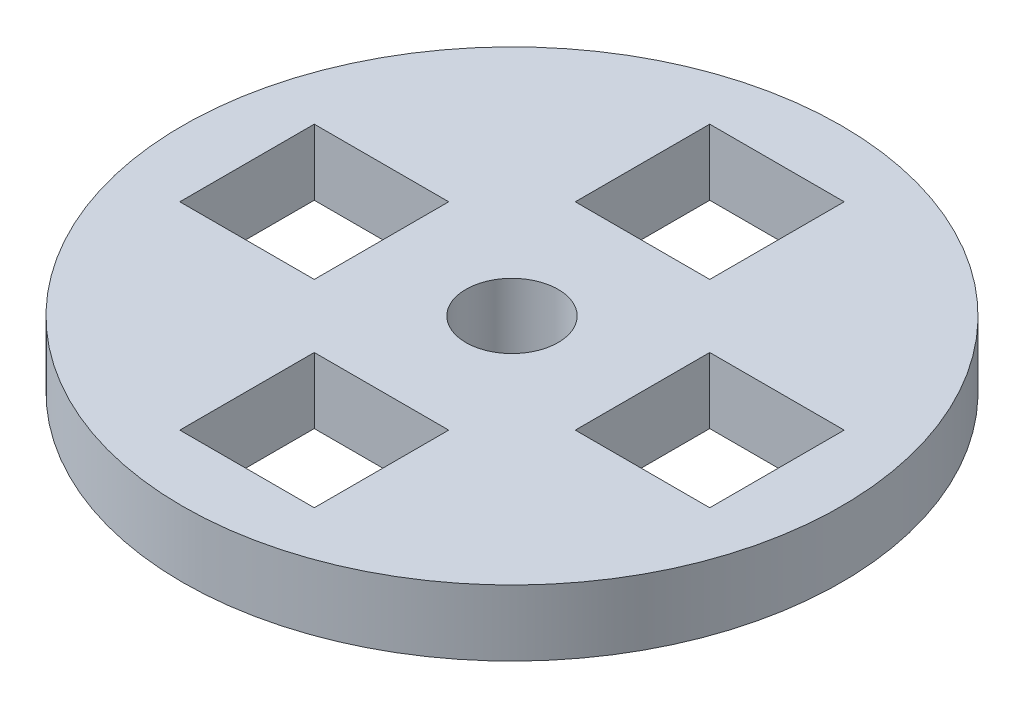
ISO-10303-21;
HEADER;
FILE_DESCRIPTION(('STEP AP214'),'2;1');
FILE_NAME('part.step','',(''),(''),'','','');
FILE_SCHEMA(('AUTOMOTIVE_DESIGN { 1 0 10303 214 1 1 1 1 }'));
ENDSEC;
DATA;
#1=APPLICATION_CONTEXT('core data for automotive mechanical design processes');
#2=APPLICATION_PROTOCOL_DEFINITION('international standard','automotive_design',2000,#1);
#3=PRODUCT_CONTEXT('',#1,'mechanical');
#4=PRODUCT('Part','Part','',(#3));
#5=PRODUCT_RELATED_PRODUCT_CATEGORY('part','',(#4));
#6=PRODUCT_DEFINITION_FORMATION('','',#4);
#7=PRODUCT_DEFINITION_CONTEXT('part definition',#1,'design');
#8=PRODUCT_DEFINITION('design','',#6,#7);
#9=PRODUCT_DEFINITION_SHAPE('','',#8);
#10=(LENGTH_UNIT() NAMED_UNIT(*) SI_UNIT(.MILLI.,.METRE.));
#11=(NAMED_UNIT(*) PLANE_ANGLE_UNIT() SI_UNIT($,.RADIAN.));
#12=(NAMED_UNIT(*) SI_UNIT($,.STERADIAN.) SOLID_ANGLE_UNIT());
#13=UNCERTAINTY_MEASURE_WITH_UNIT(LENGTH_MEASURE(1.E-05),#10,'distance_accuracy_value','');
#14=(GEOMETRIC_REPRESENTATION_CONTEXT(3) GLOBAL_UNCERTAINTY_ASSIGNED_CONTEXT((#13)) GLOBAL_UNIT_ASSIGNED_CONTEXT((#10,
#11,#12)) REPRESENTATION_CONTEXT('',''));
#15=CARTESIAN_POINT('',(0.,0.,0.));
#16=DIRECTION('',(0.,0.,1.));
#17=DIRECTION('',(1.,0.,0.));
#18=AXIS2_PLACEMENT_3D('',#15,#16,#17);
#19=CARTESIAN_POINT('',(0.,5.,0.));
#20=DIRECTION('',(0.,1.,0.));
#21=DIRECTION('',(0.,0.,1.));
#22=AXIS2_PLACEMENT_3D('',#19,#20,#21);
#23=PLANE('',#22);
#24=CARTESIAN_POINT('',(0.,5.,0.));
#25=DIRECTION('',(0.,1.,0.));
#26=DIRECTION('',(0.,0.,1.));
#27=AXIS2_PLACEMENT_3D('',#24,#25,#26);
#28=CIRCLE('',#27,3.5);
#29=CARTESIAN_POINT('',(0.,5.,3.5));
#30=VERTEX_POINT('',#29);
#31=EDGE_CURVE('E510',#30,#30,#28,.T.);
#32=ORIENTED_EDGE('',*,*,#31,.F.);
#33=EDGE_LOOP('',(#32));
#34=FACE_BOUND('',#33,.T.);
#35=CARTESIAN_POINT('',(0.,5.,0.));
#36=DIRECTION('',(0.,1.,0.));
#37=DIRECTION('',(0.,0.,1.));
#38=AXIS2_PLACEMENT_3D('',#35,#36,#37);
#39=CIRCLE('',#38,25.);
#40=CARTESIAN_POINT('',(0.,5.,25.));
#41=VERTEX_POINT('',#40);
#42=EDGE_CURVE('E11',#41,#41,#39,.T.);
#43=ORIENTED_EDGE('',*,*,#42,.T.);
#44=EDGE_LOOP('',(#43));
#45=FACE_BOUND('',#44,.T.);
#46=DIRECTION('',(-1.,0.,0.));
#47=VECTOR('',#46,1.);
#48=CARTESIAN_POINT('',(-20.1,5.,-5.09999999999998));
#49=LINE('',#48,#47);
#50=CARTESIAN_POINT('',(-9.9,5.,-5.09999999999998));
#51=VERTEX_POINT('',#50);
#52=CARTESIAN_POINT('',(-20.1,5.,-5.09999999999998));
#53=VERTEX_POINT('',#52);
#54=EDGE_CURVE('E249',#51,#53,#49,.T.);
#55=ORIENTED_EDGE('',*,*,#54,.F.);
#56=DIRECTION('',(0.,0.,-1.));
#57=VECTOR('',#56,1.);
#58=CARTESIAN_POINT('',(-9.9,5.,-5.09999999999998));
#59=LINE('',#58,#57);
#60=CARTESIAN_POINT('',(-9.9,5.,5.10000000000001));
#61=VERTEX_POINT('',#60);
#62=EDGE_CURVE('E247',#61,#51,#59,.T.);
#63=ORIENTED_EDGE('',*,*,#62,.F.);
#64=DIRECTION('',(1.,0.,0.));
#65=VECTOR('',#64,1.);
#66=CARTESIAN_POINT('',(-20.1,5.,5.10000000000001));
#67=LINE('',#66,#65);
#68=CARTESIAN_POINT('',(-20.1,5.,5.10000000000001));
#69=VERTEX_POINT('',#68);
#70=EDGE_CURVE('E255',#69,#61,#67,.T.);
#71=ORIENTED_EDGE('',*,*,#70,.F.);
#72=DIRECTION('',(0.,0.,1.));
#73=VECTOR('',#72,1.);
#74=CARTESIAN_POINT('',(-20.1,5.,-5.09999999999998));
#75=LINE('',#74,#73);
#76=EDGE_CURVE('E252',#53,#69,#75,.T.);
#77=ORIENTED_EDGE('',*,*,#76,.F.);
#78=EDGE_LOOP('',(#55,#63,#71,#77));
#79=FACE_BOUND('',#78,.T.);
#80=DIRECTION('',(1.,0.,0.));
#81=VECTOR('',#80,1.);
#82=CARTESIAN_POINT('',(20.1,5.,5.10000000000001));
#83=LINE('',#82,#81);
#84=CARTESIAN_POINT('',(9.9,5.,5.10000000000001));
#85=VERTEX_POINT('',#84);
#86=CARTESIAN_POINT('',(20.1,5.,5.10000000000001));
#87=VERTEX_POINT('',#86);
#88=EDGE_CURVE('E218',#85,#87,#83,.T.);
#89=ORIENTED_EDGE('',*,*,#88,.F.);
#90=DIRECTION('',(0.,0.,1.));
#91=VECTOR('',#90,1.);
#92=CARTESIAN_POINT('',(9.9,5.,-5.09999999999999));
#93=LINE('',#92,#91);
#94=CARTESIAN_POINT('',(9.9,5.,-5.09999999999999));
#95=VERTEX_POINT('',#94);
#96=EDGE_CURVE('E216',#95,#85,#93,.T.);
#97=ORIENTED_EDGE('',*,*,#96,.F.);
#98=DIRECTION('',(-1.,0.,0.));
#99=VECTOR('',#98,1.);
#100=CARTESIAN_POINT('',(20.1,5.,-5.09999999999999));
#101=LINE('',#100,#99);
#102=CARTESIAN_POINT('',(20.1,5.,-5.09999999999999));
#103=VERTEX_POINT('',#102);
#104=EDGE_CURVE('E224',#103,#95,#101,.T.);
#105=ORIENTED_EDGE('',*,*,#104,.F.);
#106=DIRECTION('',(0.,0.,-1.));
#107=VECTOR('',#106,1.);
#108=CARTESIAN_POINT('',(20.1,5.,-5.09999999999999));
#109=LINE('',#108,#107);
#110=EDGE_CURVE('E221',#87,#103,#109,.T.);
#111=ORIENTED_EDGE('',*,*,#110,.F.);
#112=EDGE_LOOP('',(#89,#97,#105,#111));
#113=FACE_BOUND('',#112,.T.);
#114=DIRECTION('',(-1.,0.,0.));
#115=VECTOR('',#114,1.);
#116=CARTESIAN_POINT('',(-5.1,5.,-20.1));
#117=LINE('',#116,#115);
#118=CARTESIAN_POINT('',(5.1,5.,-20.1));
#119=VERTEX_POINT('',#118);
#120=CARTESIAN_POINT('',(-5.1,5.,-20.1));
#121=VERTEX_POINT('',#120);
#122=EDGE_CURVE('E187',#119,#121,#117,.T.);
#123=ORIENTED_EDGE('',*,*,#122,.F.);
#124=DIRECTION('',(0.,0.,-1.));
#125=VECTOR('',#124,1.);
#126=CARTESIAN_POINT('',(5.1,5.,-20.1));
#127=LINE('',#126,#125);
#128=CARTESIAN_POINT('',(5.1,5.,-9.89999999999999));
#129=VERTEX_POINT('',#128);
#130=EDGE_CURVE('E185',#129,#119,#127,.T.);
#131=ORIENTED_EDGE('',*,*,#130,.F.);
#132=DIRECTION('',(1.,0.,0.));
#133=VECTOR('',#132,1.);
#134=CARTESIAN_POINT('',(-5.1,5.,-9.89999999999999));
#135=LINE('',#134,#133);
#136=CARTESIAN_POINT('',(-5.1,5.,-9.89999999999999));
#137=VERTEX_POINT('',#136);
#138=EDGE_CURVE('E193',#137,#129,#135,.T.);
#139=ORIENTED_EDGE('',*,*,#138,.F.);
#140=DIRECTION('',(0.,0.,1.));
#141=VECTOR('',#140,1.);
#142=CARTESIAN_POINT('',(-5.1,5.,-20.1));
#143=LINE('',#142,#141);
#144=EDGE_CURVE('E190',#121,#137,#143,.T.);
#145=ORIENTED_EDGE('',*,*,#144,.F.);
#146=EDGE_LOOP('',(#123,#131,#139,#145));
#147=FACE_BOUND('',#146,.T.);
#148=DIRECTION('',(-1.,0.,0.));
#149=VECTOR('',#148,1.);
#150=CARTESIAN_POINT('',(-5.1,5.,9.9));
#151=LINE('',#150,#149);
#152=CARTESIAN_POINT('',(5.1,5.,9.9));
#153=VERTEX_POINT('',#152);
#154=CARTESIAN_POINT('',(-5.1,5.,9.9));
#155=VERTEX_POINT('',#154);
#156=EDGE_CURVE('E156',#153,#155,#151,.T.);
#157=ORIENTED_EDGE('',*,*,#156,.F.);
#158=DIRECTION('',(0.,0.,-1.));
#159=VECTOR('',#158,1.);
#160=CARTESIAN_POINT('',(5.1,5.,9.9));
#161=LINE('',#160,#159);
#162=CARTESIAN_POINT('',(5.1,5.,20.1));
#163=VERTEX_POINT('',#162);
#164=EDGE_CURVE('E148',#163,#153,#161,.T.);
#165=ORIENTED_EDGE('',*,*,#164,.F.);
#166=DIRECTION('',(1.,0.,0.));
#167=VECTOR('',#166,1.);
#168=CARTESIAN_POINT('',(-5.09999999999999,5.,20.1));
#169=LINE('',#168,#167);
#170=CARTESIAN_POINT('',(-5.09999999999999,5.,20.1));
#171=VERTEX_POINT('',#170);
#172=EDGE_CURVE('E170',#171,#163,#169,.T.);
#173=ORIENTED_EDGE('',*,*,#172,.F.);
#174=DIRECTION('',(0.,0.,1.));
#175=VECTOR('',#174,1.);
#176=CARTESIAN_POINT('',(-5.1,5.,9.9));
#177=LINE('',#176,#175);
#178=EDGE_CURVE('E168',#155,#171,#177,.T.);
#179=ORIENTED_EDGE('',*,*,#178,.F.);
#180=EDGE_LOOP('',(#157,#165,#173,#179));
#181=FACE_BOUND('',#180,.T.);
#182=ADVANCED_FACE('F33',(#34,#45,#79,#113,#147,#181),#23,.T.);
#183=CARTESIAN_POINT('',(0.,0.,0.));
#184=DIRECTION('',(0.,1.,0.));
#185=DIRECTION('',(0.,0.,1.));
#186=AXIS2_PLACEMENT_3D('',#183,#184,#185);
#187=PLANE('',#186);
#188=CARTESIAN_POINT('',(0.,0.,0.));
#189=DIRECTION('',(0.,1.,0.));
#190=DIRECTION('',(0.,0.,1.));
#191=AXIS2_PLACEMENT_3D('',#188,#189,#190);
#192=CIRCLE('',#191,3.5);
#193=CARTESIAN_POINT('',(0.,0.,3.5));
#194=VERTEX_POINT('',#193);
#195=EDGE_CURVE('E37',#194,#194,#192,.T.);
#196=ORIENTED_EDGE('',*,*,#195,.T.);
#197=EDGE_LOOP('',(#196));
#198=FACE_BOUND('',#197,.T.);
#199=DIRECTION('',(0.,0.,-1.));
#200=VECTOR('',#199,1.);
#201=CARTESIAN_POINT('',(5.1,0.,-20.1));
#202=LINE('',#201,#200);
#203=CARTESIAN_POINT('',(5.1,0.,-9.89999999999999));
#204=VERTEX_POINT('',#203);
#205=CARTESIAN_POINT('',(5.1,0.,-20.1));
#206=VERTEX_POINT('',#205);
#207=EDGE_CURVE('E164',#204,#206,#202,.T.);
#208=ORIENTED_EDGE('',*,*,#207,.T.);
#209=DIRECTION('',(-1.,0.,0.));
#210=VECTOR('',#209,1.);
#211=CARTESIAN_POINT('',(-5.1,0.,-20.1));
#212=LINE('',#211,#210);
#213=CARTESIAN_POINT('',(-5.1,0.,-20.1));
#214=VERTEX_POINT('',#213);
#215=EDGE_CURVE('E198',#206,#214,#212,.T.);
#216=ORIENTED_EDGE('',*,*,#215,.T.);
#217=DIRECTION('',(0.,0.,1.));
#218=VECTOR('',#217,1.);
#219=CARTESIAN_POINT('',(-5.1,0.,-20.1));
#220=LINE('',#219,#218);
#221=CARTESIAN_POINT('',(-5.1,0.,-9.89999999999999));
#222=VERTEX_POINT('',#221);
#223=EDGE_CURVE('E201',#214,#222,#220,.T.);
#224=ORIENTED_EDGE('',*,*,#223,.T.);
#225=DIRECTION('',(1.,0.,0.));
#226=VECTOR('',#225,1.);
#227=CARTESIAN_POINT('',(-5.1,0.,-9.89999999999999));
#228=LINE('',#227,#226);
#229=EDGE_CURVE('E188',#222,#204,#228,.T.);
#230=ORIENTED_EDGE('',*,*,#229,.T.);
#231=EDGE_LOOP('',(#208,#216,#224,#230));
#232=FACE_BOUND('',#231,.T.);
#233=DIRECTION('',(0.,0.,-1.));
#234=VECTOR('',#233,1.);
#235=CARTESIAN_POINT('',(-9.9,0.,-5.09999999999998));
#236=LINE('',#235,#234);
#237=CARTESIAN_POINT('',(-9.9,0.,5.10000000000001));
#238=VERTEX_POINT('',#237);
#239=CARTESIAN_POINT('',(-9.9,0.,-5.09999999999998));
#240=VERTEX_POINT('',#239);
#241=EDGE_CURVE('E246',#238,#240,#236,.T.);
#242=ORIENTED_EDGE('',*,*,#241,.T.);
#243=DIRECTION('',(-1.,0.,0.));
#244=VECTOR('',#243,1.);
#245=CARTESIAN_POINT('',(-20.1,0.,-5.09999999999998));
#246=LINE('',#245,#244);
#247=CARTESIAN_POINT('',(-20.1,0.,-5.09999999999998));
#248=VERTEX_POINT('',#247);
#249=EDGE_CURVE('E260',#240,#248,#246,.T.);
#250=ORIENTED_EDGE('',*,*,#249,.T.);
#251=DIRECTION('',(0.,0.,1.));
#252=VECTOR('',#251,1.);
#253=CARTESIAN_POINT('',(-20.1,0.,-5.09999999999998));
#254=LINE('',#253,#252);
#255=CARTESIAN_POINT('',(-20.1,0.,5.10000000000001));
#256=VERTEX_POINT('',#255);
#257=EDGE_CURVE('E263',#248,#256,#254,.T.);
#258=ORIENTED_EDGE('',*,*,#257,.T.);
#259=DIRECTION('',(1.,0.,0.));
#260=VECTOR('',#259,1.);
#261=CARTESIAN_POINT('',(-20.1,0.,5.10000000000001));
#262=LINE('',#261,#260);
#263=EDGE_CURVE('E250',#256,#238,#262,.T.);
#264=ORIENTED_EDGE('',*,*,#263,.T.);
#265=EDGE_LOOP('',(#242,#250,#258,#264));
#266=FACE_BOUND('',#265,.T.);
#267=CARTESIAN_POINT('',(0.,0.,0.));
#268=DIRECTION('',(0.,1.,0.));
#269=DIRECTION('',(0.,0.,1.));
#270=AXIS2_PLACEMENT_3D('',#267,#268,#269);
#271=CIRCLE('',#270,25.);
#272=CARTESIAN_POINT('',(0.,0.,25.));
#273=VERTEX_POINT('',#272);
#274=EDGE_CURVE('E42',#273,#273,#271,.T.);
#275=ORIENTED_EDGE('',*,*,#274,.F.);
#276=EDGE_LOOP('',(#275));
#277=FACE_BOUND('',#276,.T.);
#278=DIRECTION('',(0.,0.,1.));
#279=VECTOR('',#278,1.);
#280=CARTESIAN_POINT('',(9.9,0.,-5.09999999999999));
#281=LINE('',#280,#279);
#282=CARTESIAN_POINT('',(9.9,0.,-5.09999999999999));
#283=VERTEX_POINT('',#282);
#284=CARTESIAN_POINT('',(9.9,0.,5.10000000000001));
#285=VERTEX_POINT('',#284);
#286=EDGE_CURVE('E215',#283,#285,#281,.T.);
#287=ORIENTED_EDGE('',*,*,#286,.T.);
#288=DIRECTION('',(1.,0.,0.));
#289=VECTOR('',#288,1.);
#290=CARTESIAN_POINT('',(20.1,0.,5.10000000000001));
#291=LINE('',#290,#289);
#292=CARTESIAN_POINT('',(20.1,0.,5.10000000000001));
#293=VERTEX_POINT('',#292);
#294=EDGE_CURVE('E229',#285,#293,#291,.T.);
#295=ORIENTED_EDGE('',*,*,#294,.T.);
#296=DIRECTION('',(0.,0.,-1.));
#297=VECTOR('',#296,1.);
#298=CARTESIAN_POINT('',(20.1,0.,-5.09999999999999));
#299=LINE('',#298,#297);
#300=CARTESIAN_POINT('',(20.1,0.,-5.09999999999999));
#301=VERTEX_POINT('',#300);
#302=EDGE_CURVE('E232',#293,#301,#299,.T.);
#303=ORIENTED_EDGE('',*,*,#302,.T.);
#304=DIRECTION('',(-1.,0.,0.));
#305=VECTOR('',#304,1.);
#306=CARTESIAN_POINT('',(20.1,0.,-5.09999999999999));
#307=LINE('',#306,#305);
#308=EDGE_CURVE('E219',#301,#283,#307,.T.);
#309=ORIENTED_EDGE('',*,*,#308,.T.);
#310=EDGE_LOOP('',(#287,#295,#303,#309));
#311=FACE_BOUND('',#310,.T.);
#312=DIRECTION('',(0.,0.,-1.));
#313=VECTOR('',#312,1.);
#314=CARTESIAN_POINT('',(5.1,0.,9.9));
#315=LINE('',#314,#313);
#316=CARTESIAN_POINT('',(5.1,0.,20.1));
#317=VERTEX_POINT('',#316);
#318=CARTESIAN_POINT('',(5.1,0.,9.9));
#319=VERTEX_POINT('',#318);
#320=EDGE_CURVE('E58',#317,#319,#315,.T.);
#321=ORIENTED_EDGE('',*,*,#320,.T.);
#322=DIRECTION('',(-1.,0.,0.));
#323=VECTOR('',#322,1.);
#324=CARTESIAN_POINT('',(-5.1,0.,9.9));
#325=LINE('',#324,#323);
#326=CARTESIAN_POINT('',(-5.1,0.,9.9));
#327=VERTEX_POINT('',#326);
#328=EDGE_CURVE('E163',#319,#327,#325,.T.);
#329=ORIENTED_EDGE('',*,*,#328,.T.);
#330=DIRECTION('',(0.,0.,1.));
#331=VECTOR('',#330,1.);
#332=CARTESIAN_POINT('',(-5.1,0.,9.9));
#333=LINE('',#332,#331);
#334=CARTESIAN_POINT('',(-5.09999999999999,0.,20.1));
#335=VERTEX_POINT('',#334);
#336=EDGE_CURVE('E177',#327,#335,#333,.T.);
#337=ORIENTED_EDGE('',*,*,#336,.T.);
#338=DIRECTION('',(1.,0.,0.));
#339=VECTOR('',#338,1.);
#340=CARTESIAN_POINT('',(-5.09999999999999,0.,20.1));
#341=LINE('',#340,#339);
#342=EDGE_CURVE('E157',#335,#317,#341,.T.);
#343=ORIENTED_EDGE('',*,*,#342,.T.);
#344=EDGE_LOOP('',(#321,#329,#337,#343));
#345=FACE_BOUND('',#344,.T.);
#346=ADVANCED_FACE('F280',(#198,#232,#266,#277,#311,#345),#187,.F.);
#347=CARTESIAN_POINT('',(0.,5.,0.));
#348=DIRECTION('',(0.,-1.,0.));
#349=DIRECTION('',(0.,0.,-1.));
#350=AXIS2_PLACEMENT_3D('',#347,#348,#349);
#351=CYLINDRICAL_SURFACE('',#350,25.);
#352=ORIENTED_EDGE('',*,*,#42,.F.);
#353=EDGE_LOOP('',(#352));
#354=FACE_BOUND('',#353,.T.);
#355=ORIENTED_EDGE('',*,*,#274,.T.);
#356=EDGE_LOOP('',(#355));
#357=FACE_BOUND('',#356,.T.);
#358=ADVANCED_FACE('F35',(#354,#357),#351,.T.);
#359=CARTESIAN_POINT('',(-9.9,5.,-5.09999999999998));
#360=DIRECTION('',(-1.,0.,0.));
#361=DIRECTION('',(0.,0.,1.));
#362=AXIS2_PLACEMENT_3D('',#359,#360,#361);
#363=PLANE('',#362);
#364=ORIENTED_EDGE('',*,*,#241,.F.);
#365=DIRECTION('',(0.,-1.,0.));
#366=VECTOR('',#365,1.);
#367=CARTESIAN_POINT('',(-9.9,5.,5.10000000000001));
#368=LINE('',#367,#366);
#369=EDGE_CURVE('E257',#61,#238,#368,.T.);
#370=ORIENTED_EDGE('',*,*,#369,.F.);
#371=ORIENTED_EDGE('',*,*,#62,.T.);
#372=DIRECTION('',(0.,-1.,0.));
#373=VECTOR('',#372,1.);
#374=CARTESIAN_POINT('',(-9.9,5.,-5.09999999999998));
#375=LINE('',#374,#373);
#376=EDGE_CURVE('E274',#51,#240,#375,.T.);
#377=ORIENTED_EDGE('',*,*,#376,.T.);
#378=EDGE_LOOP('',(#364,#370,#371,#377));
#379=FACE_BOUND('',#378,.T.);
#380=ADVANCED_FACE('F307',(#379),#363,.T.);
#381=CARTESIAN_POINT('',(-20.1,5.,-5.09999999999998));
#382=DIRECTION('',(0.,0.,1.));
#383=DIRECTION('',(1.,0.,0.));
#384=AXIS2_PLACEMENT_3D('',#381,#382,#383);
#385=PLANE('',#384);
#386=ORIENTED_EDGE('',*,*,#249,.F.);
#387=ORIENTED_EDGE('',*,*,#376,.F.);
#388=ORIENTED_EDGE('',*,*,#54,.T.);
#389=DIRECTION('',(0.,-1.,0.));
#390=VECTOR('',#389,1.);
#391=CARTESIAN_POINT('',(-20.1,5.,-5.09999999999998));
#392=LINE('',#391,#390);
#393=EDGE_CURVE('E272',#53,#248,#392,.T.);
#394=ORIENTED_EDGE('',*,*,#393,.T.);
#395=EDGE_LOOP('',(#386,#387,#388,#394));
#396=FACE_BOUND('',#395,.T.);
#397=ADVANCED_FACE('F310',(#396),#385,.T.);
#398=CARTESIAN_POINT('',(-20.1,5.,-5.09999999999998));
#399=DIRECTION('',(1.,0.,0.));
#400=DIRECTION('',(0.,0.,-1.));
#401=AXIS2_PLACEMENT_3D('',#398,#399,#400);
#402=PLANE('',#401);
#403=ORIENTED_EDGE('',*,*,#257,.F.);
#404=ORIENTED_EDGE('',*,*,#393,.F.);
#405=ORIENTED_EDGE('',*,*,#76,.T.);
#406=DIRECTION('',(0.,-1.,0.));
#407=VECTOR('',#406,1.);
#408=CARTESIAN_POINT('',(-20.1,5.,5.10000000000001));
#409=LINE('',#408,#407);
#410=EDGE_CURVE('E270',#69,#256,#409,.T.);
#411=ORIENTED_EDGE('',*,*,#410,.T.);
#412=EDGE_LOOP('',(#403,#404,#405,#411));
#413=FACE_BOUND('',#412,.T.);
#414=ADVANCED_FACE('F314',(#413),#402,.T.);
#415=CARTESIAN_POINT('',(-20.1,5.,5.10000000000001));
#416=DIRECTION('',(0.,0.,-1.));
#417=DIRECTION('',(-1.,0.,0.));
#418=AXIS2_PLACEMENT_3D('',#415,#416,#417);
#419=PLANE('',#418);
#420=ORIENTED_EDGE('',*,*,#263,.F.);
#421=ORIENTED_EDGE('',*,*,#410,.F.);
#422=ORIENTED_EDGE('',*,*,#70,.T.);
#423=ORIENTED_EDGE('',*,*,#369,.T.);
#424=EDGE_LOOP('',(#420,#421,#422,#423));
#425=FACE_BOUND('',#424,.T.);
#426=ADVANCED_FACE('F318',(#425),#419,.T.);
#427=CARTESIAN_POINT('',(9.9,5.,-5.09999999999999));
#428=DIRECTION('',(1.,0.,0.));
#429=DIRECTION('',(0.,0.,-1.));
#430=AXIS2_PLACEMENT_3D('',#427,#428,#429);
#431=PLANE('',#430);
#432=ORIENTED_EDGE('',*,*,#286,.F.);
#433=DIRECTION('',(0.,-1.,0.));
#434=VECTOR('',#433,1.);
#435=CARTESIAN_POINT('',(9.9,5.,-5.09999999999999));
#436=LINE('',#435,#434);
#437=EDGE_CURVE('E226',#95,#283,#436,.T.);
#438=ORIENTED_EDGE('',*,*,#437,.F.);
#439=ORIENTED_EDGE('',*,*,#96,.T.);
#440=DIRECTION('',(0.,-1.,0.));
#441=VECTOR('',#440,1.);
#442=CARTESIAN_POINT('',(9.9,5.,5.10000000000001));
#443=LINE('',#442,#441);
#444=EDGE_CURVE('E243',#85,#285,#443,.T.);
#445=ORIENTED_EDGE('',*,*,#444,.T.);
#446=EDGE_LOOP('',(#432,#438,#439,#445));
#447=FACE_BOUND('',#446,.T.);
#448=ADVANCED_FACE('F322',(#447),#431,.T.);
#449=CARTESIAN_POINT('',(20.1,5.,5.10000000000001));
#450=DIRECTION('',(0.,0.,-1.));
#451=DIRECTION('',(-1.,0.,0.));
#452=AXIS2_PLACEMENT_3D('',#449,#450,#451);
#453=PLANE('',#452);
#454=ORIENTED_EDGE('',*,*,#294,.F.);
#455=ORIENTED_EDGE('',*,*,#444,.F.);
#456=ORIENTED_EDGE('',*,*,#88,.T.);
#457=DIRECTION('',(0.,-1.,0.));
#458=VECTOR('',#457,1.);
#459=CARTESIAN_POINT('',(20.1,5.,5.10000000000001));
#460=LINE('',#459,#458);
#461=EDGE_CURVE('E241',#87,#293,#460,.T.);
#462=ORIENTED_EDGE('',*,*,#461,.T.);
#463=EDGE_LOOP('',(#454,#455,#456,#462));
#464=FACE_BOUND('',#463,.T.);
#465=ADVANCED_FACE('F326',(#464),#453,.T.);
#466=CARTESIAN_POINT('',(20.1,5.,-5.09999999999999));
#467=DIRECTION('',(-1.,0.,0.));
#468=DIRECTION('',(0.,0.,1.));
#469=AXIS2_PLACEMENT_3D('',#466,#467,#468);
#470=PLANE('',#469);
#471=ORIENTED_EDGE('',*,*,#302,.F.);
#472=ORIENTED_EDGE('',*,*,#461,.F.);
#473=ORIENTED_EDGE('',*,*,#110,.T.);
#474=DIRECTION('',(0.,-1.,0.));
#475=VECTOR('',#474,1.);
#476=CARTESIAN_POINT('',(20.1,5.,-5.09999999999999));
#477=LINE('',#476,#475);
#478=EDGE_CURVE('E239',#103,#301,#477,.T.);
#479=ORIENTED_EDGE('',*,*,#478,.T.);
#480=EDGE_LOOP('',(#471,#472,#473,#479));
#481=FACE_BOUND('',#480,.T.);
#482=ADVANCED_FACE('F330',(#481),#470,.T.);
#483=CARTESIAN_POINT('',(20.1,5.,-5.09999999999999));
#484=DIRECTION('',(0.,0.,1.));
#485=DIRECTION('',(1.,0.,0.));
#486=AXIS2_PLACEMENT_3D('',#483,#484,#485);
#487=PLANE('',#486);
#488=ORIENTED_EDGE('',*,*,#308,.F.);
#489=ORIENTED_EDGE('',*,*,#478,.F.);
#490=ORIENTED_EDGE('',*,*,#104,.T.);
#491=ORIENTED_EDGE('',*,*,#437,.T.);
#492=EDGE_LOOP('',(#488,#489,#490,#491));
#493=FACE_BOUND('',#492,.T.);
#494=ADVANCED_FACE('F334',(#493),#487,.T.);
#495=CARTESIAN_POINT('',(5.1,5.,-20.1));
#496=DIRECTION('',(-1.,0.,0.));
#497=DIRECTION('',(0.,0.,1.));
#498=AXIS2_PLACEMENT_3D('',#495,#496,#497);
#499=PLANE('',#498);
#500=ORIENTED_EDGE('',*,*,#207,.F.);
#501=DIRECTION('',(0.,-1.,0.));
#502=VECTOR('',#501,1.);
#503=CARTESIAN_POINT('',(5.1,5.,-9.89999999999999));
#504=LINE('',#503,#502);
#505=EDGE_CURVE('E195',#129,#204,#504,.T.);
#506=ORIENTED_EDGE('',*,*,#505,.F.);
#507=ORIENTED_EDGE('',*,*,#130,.T.);
#508=DIRECTION('',(0.,-1.,0.));
#509=VECTOR('',#508,1.);
#510=CARTESIAN_POINT('',(5.1,5.,-20.1));
#511=LINE('',#510,#509);
#512=EDGE_CURVE('E212',#119,#206,#511,.T.);
#513=ORIENTED_EDGE('',*,*,#512,.T.);
#514=EDGE_LOOP('',(#500,#506,#507,#513));
#515=FACE_BOUND('',#514,.T.);
#516=ADVANCED_FACE('F338',(#515),#499,.T.);
#517=CARTESIAN_POINT('',(-5.1,5.,-20.1));
#518=DIRECTION('',(0.,0.,1.));
#519=DIRECTION('',(1.,0.,0.));
#520=AXIS2_PLACEMENT_3D('',#517,#518,#519);
#521=PLANE('',#520);
#522=ORIENTED_EDGE('',*,*,#215,.F.);
#523=ORIENTED_EDGE('',*,*,#512,.F.);
#524=ORIENTED_EDGE('',*,*,#122,.T.);
#525=DIRECTION('',(0.,-1.,0.));
#526=VECTOR('',#525,1.);
#527=CARTESIAN_POINT('',(-5.1,5.,-20.1));
#528=LINE('',#527,#526);
#529=EDGE_CURVE('E210',#121,#214,#528,.T.);
#530=ORIENTED_EDGE('',*,*,#529,.T.);
#531=EDGE_LOOP('',(#522,#523,#524,#530));
#532=FACE_BOUND('',#531,.T.);
#533=ADVANCED_FACE('F342',(#532),#521,.T.);
#534=CARTESIAN_POINT('',(-5.1,5.,-20.1));
#535=DIRECTION('',(1.,0.,0.));
#536=DIRECTION('',(0.,0.,-1.));
#537=AXIS2_PLACEMENT_3D('',#534,#535,#536);
#538=PLANE('',#537);
#539=ORIENTED_EDGE('',*,*,#223,.F.);
#540=ORIENTED_EDGE('',*,*,#529,.F.);
#541=ORIENTED_EDGE('',*,*,#144,.T.);
#542=DIRECTION('',(0.,-1.,0.));
#543=VECTOR('',#542,1.);
#544=CARTESIAN_POINT('',(-5.1,5.,-9.89999999999999));
#545=LINE('',#544,#543);
#546=EDGE_CURVE('E208',#137,#222,#545,.T.);
#547=ORIENTED_EDGE('',*,*,#546,.T.);
#548=EDGE_LOOP('',(#539,#540,#541,#547));
#549=FACE_BOUND('',#548,.T.);
#550=ADVANCED_FACE('F346',(#549),#538,.T.);
#551=CARTESIAN_POINT('',(-5.1,5.,-9.89999999999999));
#552=DIRECTION('',(0.,0.,-1.));
#553=DIRECTION('',(-1.,0.,0.));
#554=AXIS2_PLACEMENT_3D('',#551,#552,#553);
#555=PLANE('',#554);
#556=ORIENTED_EDGE('',*,*,#229,.F.);
#557=ORIENTED_EDGE('',*,*,#546,.F.);
#558=ORIENTED_EDGE('',*,*,#138,.T.);
#559=ORIENTED_EDGE('',*,*,#505,.T.);
#560=EDGE_LOOP('',(#556,#557,#558,#559));
#561=FACE_BOUND('',#560,.T.);
#562=ADVANCED_FACE('F350',(#561),#555,.T.);
#563=CARTESIAN_POINT('',(5.1,5.,9.9));
#564=DIRECTION('',(-1.,0.,0.));
#565=DIRECTION('',(0.,0.,1.));
#566=AXIS2_PLACEMENT_3D('',#563,#564,#565);
#567=PLANE('',#566);
#568=ORIENTED_EDGE('',*,*,#320,.F.);
#569=DIRECTION('',(0.,-1.,0.));
#570=VECTOR('',#569,1.);
#571=CARTESIAN_POINT('',(5.1,5.,20.1));
#572=LINE('',#571,#570);
#573=EDGE_CURVE('E152',#163,#317,#572,.T.);
#574=ORIENTED_EDGE('',*,*,#573,.F.);
#575=ORIENTED_EDGE('',*,*,#164,.T.);
#576=DIRECTION('',(0.,-1.,0.));
#577=VECTOR('',#576,1.);
#578=CARTESIAN_POINT('',(5.1,5.,9.9));
#579=LINE('',#578,#577);
#580=EDGE_CURVE('E151',#153,#319,#579,.T.);
#581=ORIENTED_EDGE('',*,*,#580,.T.);
#582=EDGE_LOOP('',(#568,#574,#575,#581));
#583=FACE_BOUND('',#582,.T.);
#584=ADVANCED_FACE('F150',(#583),#567,.T.);
#585=CARTESIAN_POINT('',(-5.1,5.,9.9));
#586=DIRECTION('',(0.,0.,1.));
#587=DIRECTION('',(1.,0.,0.));
#588=AXIS2_PLACEMENT_3D('',#585,#586,#587);
#589=PLANE('',#588);
#590=ORIENTED_EDGE('',*,*,#328,.F.);
#591=ORIENTED_EDGE('',*,*,#580,.F.);
#592=ORIENTED_EDGE('',*,*,#156,.T.);
#593=DIRECTION('',(0.,-1.,0.));
#594=VECTOR('',#593,1.);
#595=CARTESIAN_POINT('',(-5.1,5.,9.9));
#596=LINE('',#595,#594);
#597=EDGE_CURVE('E165',#155,#327,#596,.T.);
#598=ORIENTED_EDGE('',*,*,#597,.T.);
#599=EDGE_LOOP('',(#590,#591,#592,#598));
#600=FACE_BOUND('',#599,.T.);
#601=ADVANCED_FACE('F160',(#600),#589,.T.);
#602=CARTESIAN_POINT('',(-5.1,5.,9.9));
#603=DIRECTION('',(1.,0.,0.));
#604=DIRECTION('',(0.,0.,-1.));
#605=AXIS2_PLACEMENT_3D('',#602,#603,#604);
#606=PLANE('',#605);
#607=ORIENTED_EDGE('',*,*,#336,.F.);
#608=ORIENTED_EDGE('',*,*,#597,.F.);
#609=ORIENTED_EDGE('',*,*,#178,.T.);
#610=DIRECTION('',(0.,-1.,0.));
#611=VECTOR('',#610,1.);
#612=CARTESIAN_POINT('',(-5.09999999999999,5.,20.1));
#613=LINE('',#612,#611);
#614=EDGE_CURVE('E50',#171,#335,#613,.T.);
#615=ORIENTED_EDGE('',*,*,#614,.T.);
#616=EDGE_LOOP('',(#607,#608,#609,#615));
#617=FACE_BOUND('',#616,.T.);
#618=ADVANCED_FACE('F289',(#617),#606,.T.);
#619=CARTESIAN_POINT('',(-5.09999999999999,5.,20.1));
#620=DIRECTION('',(0.,0.,-1.));
#621=DIRECTION('',(-1.,0.,0.));
#622=AXIS2_PLACEMENT_3D('',#619,#620,#621);
#623=PLANE('',#622);
#624=ORIENTED_EDGE('',*,*,#342,.F.);
#625=ORIENTED_EDGE('',*,*,#614,.F.);
#626=ORIENTED_EDGE('',*,*,#172,.T.);
#627=ORIENTED_EDGE('',*,*,#573,.T.);
#628=EDGE_LOOP('',(#624,#625,#626,#627));
#629=FACE_BOUND('',#628,.T.);
#630=ADVANCED_FACE('F286',(#629),#623,.T.);
#631=CARTESIAN_POINT('',(0.,-42.,0.));
#632=DIRECTION('',(0.,1.,0.));
#633=DIRECTION('',(0.,0.,1.));
#634=AXIS2_PLACEMENT_3D('',#631,#632,#633);
#635=CYLINDRICAL_SURFACE('',#634,3.5);
#636=ORIENTED_EDGE('',*,*,#31,.T.);
#637=EDGE_LOOP('',(#636));
#638=FACE_BOUND('',#637,.T.);
#639=ORIENTED_EDGE('',*,*,#195,.F.);
#640=EDGE_LOOP('',(#639));
#641=FACE_BOUND('',#640,.T.);
#642=ADVANCED_FACE('F288',(#638,#641),#635,.F.);
#643=CLOSED_SHELL('',(#182,#346,#358,#380,#397,#414,#426,#448,#465,#482,#494,#516,#533,#550,
#562,#584,#601,#618,#630,#642));
#644=MANIFOLD_SOLID_BREP('B2',#643);
#645=ADVANCED_BREP_SHAPE_REPRESENTATION('',(#18,#644),#14);
#646=SHAPE_DEFINITION_REPRESENTATION(#9,#645);
ENDSEC;
END-ISO-10303-21;
